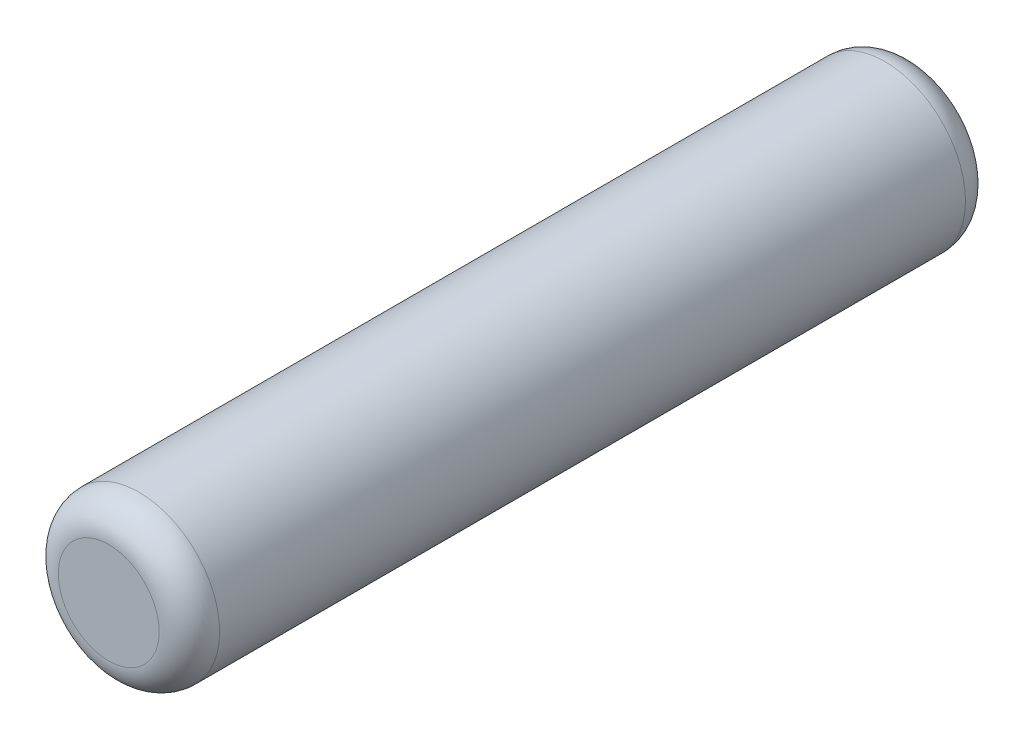
ISO-10303-21;
HEADER;
FILE_DESCRIPTION(('STEP AP214'),'2;1');
FILE_NAME('part.step','',(''),(''),'','','');
FILE_SCHEMA(('AUTOMOTIVE_DESIGN { 1 0 10303 214 1 1 1 1 }'));
ENDSEC;
DATA;
#1=APPLICATION_CONTEXT('core data for automotive mechanical design processes');
#2=APPLICATION_PROTOCOL_DEFINITION('international standard','automotive_design',2000,#1);
#3=PRODUCT_CONTEXT('',#1,'mechanical');
#4=PRODUCT('Part','Part','',(#3));
#5=PRODUCT_RELATED_PRODUCT_CATEGORY('part','',(#4));
#6=PRODUCT_DEFINITION_FORMATION('','',#4);
#7=PRODUCT_DEFINITION_CONTEXT('part definition',#1,'design');
#8=PRODUCT_DEFINITION('design','',#6,#7);
#9=PRODUCT_DEFINITION_SHAPE('','',#8);
#10=(LENGTH_UNIT() NAMED_UNIT(*) SI_UNIT(.MILLI.,.METRE.));
#11=(NAMED_UNIT(*) PLANE_ANGLE_UNIT() SI_UNIT($,.RADIAN.));
#12=(NAMED_UNIT(*) SI_UNIT($,.STERADIAN.) SOLID_ANGLE_UNIT());
#13=UNCERTAINTY_MEASURE_WITH_UNIT(LENGTH_MEASURE(1.E-05),#10,'distance_accuracy_value','');
#14=(GEOMETRIC_REPRESENTATION_CONTEXT(3) GLOBAL_UNCERTAINTY_ASSIGNED_CONTEXT((#13)) GLOBAL_UNIT_ASSIGNED_CONTEXT((#10,
#11,#12)) REPRESENTATION_CONTEXT('',''));
#15=CARTESIAN_POINT('',(0.,0.,0.));
#16=DIRECTION('',(0.,0.,1.));
#17=DIRECTION('',(1.,0.,0.));
#18=AXIS2_PLACEMENT_3D('',#15,#16,#17);
#19=CARTESIAN_POINT('',(0.,0.,20.));
#20=DIRECTION('',(0.,0.,-1.));
#21=DIRECTION('',(-1.,0.,0.));
#22=AXIS2_PLACEMENT_3D('',#19,#20,#21);
#23=CYLINDRICAL_SURFACE('',#22,4.);
#24=CARTESIAN_POINT('',(0.,0.,-18.5));
#25=DIRECTION('',(0.,0.,1.));
#26=DIRECTION('',(1.,0.,0.));
#27=AXIS2_PLACEMENT_3D('',#24,#25,#26);
#28=CIRCLE('',#27,4.);
#29=CARTESIAN_POINT('',(4.,0.,-18.5));
#30=VERTEX_POINT('',#29);
#31=EDGE_CURVE('E42',#30,#30,#28,.T.);
#32=ORIENTED_EDGE('',*,*,#31,.T.);
#33=EDGE_LOOP('',(#32));
#34=FACE_BOUND('',#33,.T.);
#35=CARTESIAN_POINT('',(0.,0.,18.5));
#36=DIRECTION('',(0.,0.,1.));
#37=DIRECTION('',(1.,0.,0.));
#38=AXIS2_PLACEMENT_3D('',#35,#36,#37);
#39=CIRCLE('',#38,4.);
#40=CARTESIAN_POINT('',(4.,0.,18.5));
#41=VERTEX_POINT('',#40);
#42=EDGE_CURVE('E46',#41,#41,#39,.F.);
#43=ORIENTED_EDGE('',*,*,#42,.T.);
#44=EDGE_LOOP('',(#43));
#45=FACE_BOUND('',#44,.T.);
#46=ADVANCED_FACE('F31',(#34,#45),#23,.T.);
#47=CARTESIAN_POINT('',(0.,0.,20.));
#48=DIRECTION('',(0.,0.,1.));
#49=DIRECTION('',(1.,0.,0.));
#50=AXIS2_PLACEMENT_3D('',#47,#48,#49);
#51=PLANE('',#50);
#52=CARTESIAN_POINT('',(0.,0.,20.));
#53=DIRECTION('',(0.,0.,1.));
#54=DIRECTION('',(1.,0.,0.));
#55=AXIS2_PLACEMENT_3D('',#52,#53,#54);
#56=CIRCLE('',#55,2.5);
#57=CARTESIAN_POINT('',(2.5,0.,20.));
#58=VERTEX_POINT('',#57);
#59=EDGE_CURVE('E10',#58,#58,#56,.T.);
#60=ORIENTED_EDGE('',*,*,#59,.T.);
#61=EDGE_LOOP('',(#60));
#62=FACE_BOUND('',#61,.T.);
#63=ADVANCED_FACE('F62',(#62),#51,.T.);
#64=CARTESIAN_POINT('',(0.,0.,-20.));
#65=DIRECTION('',(0.,0.,1.));
#66=DIRECTION('',(1.,0.,0.));
#67=AXIS2_PLACEMENT_3D('',#64,#65,#66);
#68=PLANE('',#67);
#69=CARTESIAN_POINT('',(0.,0.,-20.));
#70=DIRECTION('',(0.,0.,1.));
#71=DIRECTION('',(1.,0.,0.));
#72=AXIS2_PLACEMENT_3D('',#69,#70,#71);
#73=CIRCLE('',#72,2.5);
#74=CARTESIAN_POINT('',(2.5,0.,-20.));
#75=VERTEX_POINT('',#74);
#76=EDGE_CURVE('E38',#75,#75,#73,.F.);
#77=ORIENTED_EDGE('',*,*,#76,.T.);
#78=EDGE_LOOP('',(#77));
#79=FACE_BOUND('',#78,.T.);
#80=ADVANCED_FACE('F59',(#79),#68,.F.);
#81=CARTESIAN_POINT('',(0.,0.,-18.5));
#82=DIRECTION('',(0.,0.,1.));
#83=DIRECTION('',(1.,0.,0.));
#84=AXIS2_PLACEMENT_3D('',#81,#82,#83);
#85=TOROIDAL_SURFACE('',#84,2.5,1.5);
#86=ORIENTED_EDGE('',*,*,#76,.F.);
#87=EDGE_LOOP('',(#86));
#88=FACE_BOUND('',#87,.T.);
#89=ORIENTED_EDGE('',*,*,#31,.F.);
#90=EDGE_LOOP('',(#89));
#91=FACE_BOUND('',#90,.T.);
#92=ADVANCED_FACE('F55',(#88,#91),#85,.T.);
#93=CARTESIAN_POINT('',(0.,0.,18.5));
#94=DIRECTION('',(0.,0.,1.));
#95=DIRECTION('',(1.,0.,0.));
#96=AXIS2_PLACEMENT_3D('',#93,#94,#95);
#97=TOROIDAL_SURFACE('',#96,2.5,1.5);
#98=ORIENTED_EDGE('',*,*,#42,.F.);
#99=EDGE_LOOP('',(#98));
#100=FACE_BOUND('',#99,.T.);
#101=ORIENTED_EDGE('',*,*,#59,.F.);
#102=EDGE_LOOP('',(#101));
#103=FACE_BOUND('',#102,.T.);
#104=ADVANCED_FACE('F33',(#100,#103),#97,.T.);
#105=CLOSED_SHELL('',(#46,#63,#80,#92,#104));
#106=MANIFOLD_SOLID_BREP('B2',#105);
#107=ADVANCED_BREP_SHAPE_REPRESENTATION('',(#18,#106),#14);
#108=SHAPE_DEFINITION_REPRESENTATION(#9,#107);
ENDSEC;
END-ISO-10303-21;
